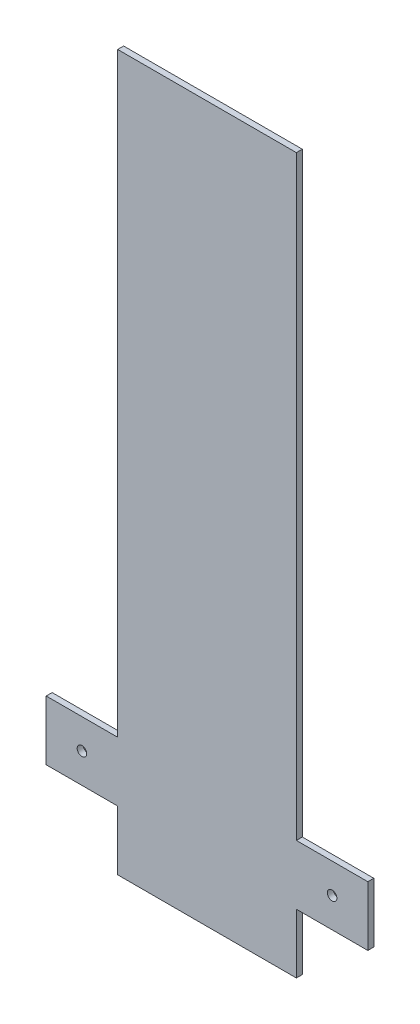
ISO-10303-21;
HEADER;
FILE_DESCRIPTION(('STEP AP214'),'2;1');
FILE_NAME('part.step','',(''),(''),'','','');
FILE_SCHEMA(('AUTOMOTIVE_DESIGN { 1 0 10303 214 1 1 1 1 }'));
ENDSEC;
DATA;
#1=APPLICATION_CONTEXT('core data for automotive mechanical design processes');
#2=APPLICATION_PROTOCOL_DEFINITION('international standard','automotive_design',2000,#1);
#3=PRODUCT_CONTEXT('',#1,'mechanical');
#4=PRODUCT('Part','Part','',(#3));
#5=PRODUCT_RELATED_PRODUCT_CATEGORY('part','',(#4));
#6=PRODUCT_DEFINITION_FORMATION('','',#4);
#7=PRODUCT_DEFINITION_CONTEXT('part definition',#1,'design');
#8=PRODUCT_DEFINITION('design','',#6,#7);
#9=PRODUCT_DEFINITION_SHAPE('','',#8);
#10=(LENGTH_UNIT() NAMED_UNIT(*) SI_UNIT(.MILLI.,.METRE.));
#11=(NAMED_UNIT(*) PLANE_ANGLE_UNIT() SI_UNIT($,.RADIAN.));
#12=(NAMED_UNIT(*) SI_UNIT($,.STERADIAN.) SOLID_ANGLE_UNIT());
#13=UNCERTAINTY_MEASURE_WITH_UNIT(LENGTH_MEASURE(1.E-05),#10,'distance_accuracy_value','');
#14=(GEOMETRIC_REPRESENTATION_CONTEXT(3) GLOBAL_UNCERTAINTY_ASSIGNED_CONTEXT((#13)) GLOBAL_UNIT_ASSIGNED_CONTEXT((#10,
#11,#12)) REPRESENTATION_CONTEXT('',''));
#15=CARTESIAN_POINT('',(0.,0.,0.));
#16=DIRECTION('',(0.,0.,1.));
#17=DIRECTION('',(1.,0.,0.));
#18=AXIS2_PLACEMENT_3D('',#15,#16,#17);
#19=CARTESIAN_POINT('',(0.,0.,5.));
#20=DIRECTION('',(0.,0.,1.));
#21=DIRECTION('',(1.,0.,0.));
#22=AXIS2_PLACEMENT_3D('',#19,#20,#21);
#23=PLANE('',#22);
#24=CARTESIAN_POINT('',(-105.,-225.,5.));
#25=DIRECTION('',(0.,0.,1.));
#26=DIRECTION('',(1.,0.,0.));
#27=AXIS2_PLACEMENT_3D('',#24,#25,#26);
#28=CIRCLE('',#27,3.99999999999999);
#29=CARTESIAN_POINT('',(-101.,-225.,5.));
#30=VERTEX_POINT('',#29);
#31=EDGE_CURVE('E224',#30,#30,#28,.T.);
#32=ORIENTED_EDGE('',*,*,#31,.F.);
#33=EDGE_LOOP('',(#32));
#34=FACE_BOUND('',#33,.T.);
#35=DIRECTION('',(1.,0.,0.));
#36=VECTOR('',#35,1.);
#37=CARTESIAN_POINT('',(135.,-250.,5.));
#38=LINE('',#37,#36);
#39=CARTESIAN_POINT('',(75.,-250.,5.));
#40=VERTEX_POINT('',#39);
#41=CARTESIAN_POINT('',(135.,-250.,5.));
#42=VERTEX_POINT('',#41);
#43=EDGE_CURVE('E215',#40,#42,#38,.T.);
#44=ORIENTED_EDGE('',*,*,#43,.T.);
#45=DIRECTION('',(0.,1.,0.));
#46=VECTOR('',#45,1.);
#47=CARTESIAN_POINT('',(135.,-200.,5.));
#48=LINE('',#47,#46);
#49=CARTESIAN_POINT('',(135.,-200.,5.));
#50=VERTEX_POINT('',#49);
#51=EDGE_CURVE('E115',#42,#50,#48,.T.);
#52=ORIENTED_EDGE('',*,*,#51,.T.);
#53=DIRECTION('',(-1.,0.,0.));
#54=VECTOR('',#53,1.);
#55=CARTESIAN_POINT('',(75.,-200.,5.));
#56=LINE('',#55,#54);
#57=CARTESIAN_POINT('',(75.,-200.,5.));
#58=VERTEX_POINT('',#57);
#59=EDGE_CURVE('E204',#50,#58,#56,.T.);
#60=ORIENTED_EDGE('',*,*,#59,.T.);
#61=DIRECTION('',(0.,1.,0.));
#62=VECTOR('',#61,1.);
#63=CARTESIAN_POINT('',(75.,300.,5.));
#64=LINE('',#63,#62);
#65=CARTESIAN_POINT('',(75.,300.,5.));
#66=VERTEX_POINT('',#65);
#67=EDGE_CURVE('E200',#58,#66,#64,.T.);
#68=ORIENTED_EDGE('',*,*,#67,.T.);
#69=DIRECTION('',(-1.,0.,0.));
#70=VECTOR('',#69,1.);
#71=CARTESIAN_POINT('',(75.,300.,5.));
#72=LINE('',#71,#70);
#73=CARTESIAN_POINT('',(-75.,300.,5.));
#74=VERTEX_POINT('',#73);
#75=EDGE_CURVE('E197',#66,#74,#72,.T.);
#76=ORIENTED_EDGE('',*,*,#75,.T.);
#77=DIRECTION('',(0.,-1.,0.));
#78=VECTOR('',#77,1.);
#79=CARTESIAN_POINT('',(-75.,300.,5.));
#80=LINE('',#79,#78);
#81=CARTESIAN_POINT('',(-75.,-200.,5.));
#82=VERTEX_POINT('',#81);
#83=EDGE_CURVE('E189',#74,#82,#80,.T.);
#84=ORIENTED_EDGE('',*,*,#83,.T.);
#85=DIRECTION('',(-1.,0.,0.));
#86=VECTOR('',#85,1.);
#87=CARTESIAN_POINT('',(-75.,-200.,5.));
#88=LINE('',#87,#86);
#89=CARTESIAN_POINT('',(-135.,-200.,5.));
#90=VERTEX_POINT('',#89);
#91=EDGE_CURVE('E185',#82,#90,#88,.T.);
#92=ORIENTED_EDGE('',*,*,#91,.T.);
#93=DIRECTION('',(0.,-1.,0.));
#94=VECTOR('',#93,1.);
#95=CARTESIAN_POINT('',(-135.,-200.,5.));
#96=LINE('',#95,#94);
#97=CARTESIAN_POINT('',(-135.,-250.,5.));
#98=VERTEX_POINT('',#97);
#99=EDGE_CURVE('E181',#90,#98,#96,.T.);
#100=ORIENTED_EDGE('',*,*,#99,.T.);
#101=DIRECTION('',(1.,0.,0.));
#102=VECTOR('',#101,1.);
#103=CARTESIAN_POINT('',(-135.,-250.,5.));
#104=LINE('',#103,#102);
#105=CARTESIAN_POINT('',(-75.,-250.,5.));
#106=VERTEX_POINT('',#105);
#107=EDGE_CURVE('E146',#98,#106,#104,.T.);
#108=ORIENTED_EDGE('',*,*,#107,.T.);
#109=DIRECTION('',(0.,-1.,0.));
#110=VECTOR('',#109,1.);
#111=CARTESIAN_POINT('',(-75.,-250.,5.));
#112=LINE('',#111,#110);
#113=CARTESIAN_POINT('',(-75.,-300.,5.));
#114=VERTEX_POINT('',#113);
#115=EDGE_CURVE('E140',#106,#114,#112,.T.);
#116=ORIENTED_EDGE('',*,*,#115,.T.);
#117=DIRECTION('',(1.,0.,0.));
#118=VECTOR('',#117,1.);
#119=CARTESIAN_POINT('',(-75.,-300.,5.));
#120=LINE('',#119,#118);
#121=CARTESIAN_POINT('',(75.,-300.,5.));
#122=VERTEX_POINT('',#121);
#123=EDGE_CURVE('E144',#114,#122,#120,.T.);
#124=ORIENTED_EDGE('',*,*,#123,.T.);
#125=DIRECTION('',(0.,1.,0.));
#126=VECTOR('',#125,1.);
#127=CARTESIAN_POINT('',(75.,-250.,5.));
#128=LINE('',#127,#126);
#129=EDGE_CURVE('E60',#122,#40,#128,.T.);
#130=ORIENTED_EDGE('',*,*,#129,.T.);
#131=EDGE_LOOP('',(#44,#52,#60,#68,#76,#84,#92,#100,#108,#116,#124,#130));
#132=FACE_BOUND('',#131,.T.);
#133=CARTESIAN_POINT('',(105.,-225.,5.));
#134=DIRECTION('',(0.,0.,1.));
#135=DIRECTION('',(1.,0.,0.));
#136=AXIS2_PLACEMENT_3D('',#133,#134,#135);
#137=CIRCLE('',#136,3.99999999999999);
#138=CARTESIAN_POINT('',(109.,-225.,5.));
#139=VERTEX_POINT('',#138);
#140=EDGE_CURVE('E225',#139,#139,#137,.T.);
#141=ORIENTED_EDGE('',*,*,#140,.F.);
#142=EDGE_LOOP('',(#141));
#143=FACE_BOUND('',#142,.T.);
#144=ADVANCED_FACE('F41',(#34,#132,#143),#23,.T.);
#145=CARTESIAN_POINT('',(0.,0.,0.));
#146=DIRECTION('',(0.,0.,1.));
#147=DIRECTION('',(1.,0.,0.));
#148=AXIS2_PLACEMENT_3D('',#145,#146,#147);
#149=PLANE('',#148);
#150=DIRECTION('',(1.,0.,0.));
#151=VECTOR('',#150,1.);
#152=CARTESIAN_POINT('',(135.,-250.,0.));
#153=LINE('',#152,#151);
#154=CARTESIAN_POINT('',(75.,-250.,0.));
#155=VERTEX_POINT('',#154);
#156=CARTESIAN_POINT('',(135.,-250.,0.));
#157=VERTEX_POINT('',#156);
#158=EDGE_CURVE('E311',#155,#157,#153,.T.);
#159=ORIENTED_EDGE('',*,*,#158,.F.);
#160=DIRECTION('',(0.,1.,0.));
#161=VECTOR('',#160,1.);
#162=CARTESIAN_POINT('',(75.,-250.,0.));
#163=LINE('',#162,#161);
#164=CARTESIAN_POINT('',(75.,-300.,0.));
#165=VERTEX_POINT('',#164);
#166=EDGE_CURVE('E107',#165,#155,#163,.T.);
#167=ORIENTED_EDGE('',*,*,#166,.F.);
#168=DIRECTION('',(1.,0.,0.));
#169=VECTOR('',#168,1.);
#170=CARTESIAN_POINT('',(-75.,-300.,0.));
#171=LINE('',#170,#169);
#172=CARTESIAN_POINT('',(-75.,-300.,0.));
#173=VERTEX_POINT('',#172);
#174=EDGE_CURVE('E101',#173,#165,#171,.T.);
#175=ORIENTED_EDGE('',*,*,#174,.F.);
#176=DIRECTION('',(0.,-1.,0.));
#177=VECTOR('',#176,1.);
#178=CARTESIAN_POINT('',(-75.,-250.,0.));
#179=LINE('',#178,#177);
#180=CARTESIAN_POINT('',(-75.,-250.,0.));
#181=VERTEX_POINT('',#180);
#182=EDGE_CURVE('E155',#181,#173,#179,.T.);
#183=ORIENTED_EDGE('',*,*,#182,.F.);
#184=DIRECTION('',(1.,0.,0.));
#185=VECTOR('',#184,1.);
#186=CARTESIAN_POINT('',(-135.,-250.,0.));
#187=LINE('',#186,#185);
#188=CARTESIAN_POINT('',(-135.,-250.,0.));
#189=VERTEX_POINT('',#188);
#190=EDGE_CURVE('E415',#189,#181,#187,.T.);
#191=ORIENTED_EDGE('',*,*,#190,.F.);
#192=DIRECTION('',(0.,-1.,0.));
#193=VECTOR('',#192,1.);
#194=CARTESIAN_POINT('',(-135.,-200.,0.));
#195=LINE('',#194,#193);
#196=CARTESIAN_POINT('',(-135.,-200.,0.));
#197=VERTEX_POINT('',#196);
#198=EDGE_CURVE('E413',#197,#189,#195,.T.);
#199=ORIENTED_EDGE('',*,*,#198,.F.);
#200=DIRECTION('',(-1.,0.,0.));
#201=VECTOR('',#200,1.);
#202=CARTESIAN_POINT('',(-75.,-200.,0.));
#203=LINE('',#202,#201);
#204=CARTESIAN_POINT('',(-75.,-200.,0.));
#205=VERTEX_POINT('',#204);
#206=EDGE_CURVE('E409',#205,#197,#203,.T.);
#207=ORIENTED_EDGE('',*,*,#206,.F.);
#208=DIRECTION('',(0.,-1.,0.));
#209=VECTOR('',#208,1.);
#210=CARTESIAN_POINT('',(-75.,300.,0.));
#211=LINE('',#210,#209);
#212=CARTESIAN_POINT('',(-75.,300.,0.));
#213=VERTEX_POINT('',#212);
#214=EDGE_CURVE('E405',#213,#205,#211,.T.);
#215=ORIENTED_EDGE('',*,*,#214,.F.);
#216=DIRECTION('',(-1.,0.,0.));
#217=VECTOR('',#216,1.);
#218=CARTESIAN_POINT('',(75.,300.,0.));
#219=LINE('',#218,#217);
#220=CARTESIAN_POINT('',(75.,300.,0.));
#221=VERTEX_POINT('',#220);
#222=EDGE_CURVE('E324',#221,#213,#219,.T.);
#223=ORIENTED_EDGE('',*,*,#222,.F.);
#224=DIRECTION('',(0.,1.,0.));
#225=VECTOR('',#224,1.);
#226=CARTESIAN_POINT('',(75.,300.,0.));
#227=LINE('',#226,#225);
#228=CARTESIAN_POINT('',(75.,-200.,0.));
#229=VERTEX_POINT('',#228);
#230=EDGE_CURVE('E320',#229,#221,#227,.T.);
#231=ORIENTED_EDGE('',*,*,#230,.F.);
#232=DIRECTION('',(-1.,0.,0.));
#233=VECTOR('',#232,1.);
#234=CARTESIAN_POINT('',(75.,-200.,0.));
#235=LINE('',#234,#233);
#236=CARTESIAN_POINT('',(135.,-200.,0.));
#237=VERTEX_POINT('',#236);
#238=EDGE_CURVE('E310',#237,#229,#235,.T.);
#239=ORIENTED_EDGE('',*,*,#238,.F.);
#240=DIRECTION('',(0.,1.,0.));
#241=VECTOR('',#240,1.);
#242=CARTESIAN_POINT('',(135.,-200.,0.));
#243=LINE('',#242,#241);
#244=EDGE_CURVE('E302',#157,#237,#243,.T.);
#245=ORIENTED_EDGE('',*,*,#244,.F.);
#246=EDGE_LOOP('',(#159,#167,#175,#183,#191,#199,#207,#215,#223,#231,#239,#245));
#247=FACE_BOUND('',#246,.T.);
#248=CARTESIAN_POINT('',(-105.,-225.,0.));
#249=DIRECTION('',(0.,0.,1.));
#250=DIRECTION('',(1.,0.,0.));
#251=AXIS2_PLACEMENT_3D('',#248,#249,#250);
#252=CIRCLE('',#251,3.99999999999999);
#253=CARTESIAN_POINT('',(-101.,-225.,0.));
#254=VERTEX_POINT('',#253);
#255=EDGE_CURVE('E219',#254,#254,#252,.T.);
#256=ORIENTED_EDGE('',*,*,#255,.T.);
#257=EDGE_LOOP('',(#256));
#258=FACE_BOUND('',#257,.T.);
#259=CARTESIAN_POINT('',(105.,-225.,0.));
#260=DIRECTION('',(0.,0.,1.));
#261=DIRECTION('',(1.,0.,0.));
#262=AXIS2_PLACEMENT_3D('',#259,#260,#261);
#263=CIRCLE('',#262,3.99999999999999);
#264=CARTESIAN_POINT('',(109.,-225.,0.));
#265=VERTEX_POINT('',#264);
#266=EDGE_CURVE('E234',#265,#265,#263,.T.);
#267=ORIENTED_EDGE('',*,*,#266,.T.);
#268=EDGE_LOOP('',(#267));
#269=FACE_BOUND('',#268,.T.);
#270=ADVANCED_FACE('F240',(#247,#258,#269),#149,.F.);
#271=CARTESIAN_POINT('',(135.,-250.,5.));
#272=DIRECTION('',(0.,1.,0.));
#273=DIRECTION('',(0.,0.,1.));
#274=AXIS2_PLACEMENT_3D('',#271,#272,#273);
#275=PLANE('',#274);
#276=ORIENTED_EDGE('',*,*,#158,.T.);
#277=DIRECTION('',(0.,0.,-1.));
#278=VECTOR('',#277,1.);
#279=CARTESIAN_POINT('',(135.,-250.,5.));
#280=LINE('',#279,#278);
#281=EDGE_CURVE('E12',#42,#157,#280,.T.);
#282=ORIENTED_EDGE('',*,*,#281,.F.);
#283=ORIENTED_EDGE('',*,*,#43,.F.);
#284=DIRECTION('',(0.,0.,-1.));
#285=VECTOR('',#284,1.);
#286=CARTESIAN_POINT('',(75.,-250.,5.));
#287=LINE('',#286,#285);
#288=EDGE_CURVE('E164',#40,#155,#287,.T.);
#289=ORIENTED_EDGE('',*,*,#288,.T.);
#290=EDGE_LOOP('',(#276,#282,#283,#289));
#291=FACE_BOUND('',#290,.T.);
#292=ADVANCED_FACE('F43',(#291),#275,.F.);
#293=CARTESIAN_POINT('',(135.,-200.,5.));
#294=DIRECTION('',(-1.,0.,0.));
#295=DIRECTION('',(0.,0.,1.));
#296=AXIS2_PLACEMENT_3D('',#293,#294,#295);
#297=PLANE('',#296);
#298=ORIENTED_EDGE('',*,*,#244,.T.);
#299=DIRECTION('',(0.,0.,-1.));
#300=VECTOR('',#299,1.);
#301=CARTESIAN_POINT('',(135.,-200.,5.));
#302=LINE('',#301,#300);
#303=EDGE_CURVE('E52',#50,#237,#302,.T.);
#304=ORIENTED_EDGE('',*,*,#303,.F.);
#305=ORIENTED_EDGE('',*,*,#51,.F.);
#306=ORIENTED_EDGE('',*,*,#281,.T.);
#307=EDGE_LOOP('',(#298,#304,#305,#306));
#308=FACE_BOUND('',#307,.T.);
#309=ADVANCED_FACE('F295',(#308),#297,.F.);
#310=CARTESIAN_POINT('',(75.,-200.,5.));
#311=DIRECTION('',(0.,-1.,0.));
#312=DIRECTION('',(0.,0.,-1.));
#313=AXIS2_PLACEMENT_3D('',#310,#311,#312);
#314=PLANE('',#313);
#315=ORIENTED_EDGE('',*,*,#238,.T.);
#316=DIRECTION('',(0.,0.,-1.));
#317=VECTOR('',#316,1.);
#318=CARTESIAN_POINT('',(75.,-200.,5.));
#319=LINE('',#318,#317);
#320=EDGE_CURVE('E316',#58,#229,#319,.T.);
#321=ORIENTED_EDGE('',*,*,#320,.F.);
#322=ORIENTED_EDGE('',*,*,#59,.F.);
#323=ORIENTED_EDGE('',*,*,#303,.T.);
#324=EDGE_LOOP('',(#315,#321,#322,#323));
#325=FACE_BOUND('',#324,.T.);
#326=ADVANCED_FACE('F292',(#325),#314,.F.);
#327=CARTESIAN_POINT('',(75.,300.,5.));
#328=DIRECTION('',(-1.,0.,0.));
#329=DIRECTION('',(0.,0.,1.));
#330=AXIS2_PLACEMENT_3D('',#327,#328,#329);
#331=PLANE('',#330);
#332=ORIENTED_EDGE('',*,*,#230,.T.);
#333=DIRECTION('',(0.,0.,-1.));
#334=VECTOR('',#333,1.);
#335=CARTESIAN_POINT('',(75.,300.,5.));
#336=LINE('',#335,#334);
#337=EDGE_CURVE('E383',#66,#221,#336,.T.);
#338=ORIENTED_EDGE('',*,*,#337,.F.);
#339=ORIENTED_EDGE('',*,*,#67,.F.);
#340=ORIENTED_EDGE('',*,*,#320,.T.);
#341=EDGE_LOOP('',(#332,#338,#339,#340));
#342=FACE_BOUND('',#341,.T.);
#343=ADVANCED_FACE('F288',(#342),#331,.F.);
#344=CARTESIAN_POINT('',(75.,300.,5.));
#345=DIRECTION('',(0.,-1.,0.));
#346=DIRECTION('',(0.,0.,-1.));
#347=AXIS2_PLACEMENT_3D('',#344,#345,#346);
#348=PLANE('',#347);
#349=ORIENTED_EDGE('',*,*,#222,.T.);
#350=DIRECTION('',(0.,0.,-1.));
#351=VECTOR('',#350,1.);
#352=CARTESIAN_POINT('',(-75.,300.,5.));
#353=LINE('',#352,#351);
#354=EDGE_CURVE('E378',#74,#213,#353,.T.);
#355=ORIENTED_EDGE('',*,*,#354,.F.);
#356=ORIENTED_EDGE('',*,*,#75,.F.);
#357=ORIENTED_EDGE('',*,*,#337,.T.);
#358=EDGE_LOOP('',(#349,#355,#356,#357));
#359=FACE_BOUND('',#358,.T.);
#360=ADVANCED_FACE('F284',(#359),#348,.F.);
#361=CARTESIAN_POINT('',(-75.,300.,5.));
#362=DIRECTION('',(1.,0.,0.));
#363=DIRECTION('',(0.,0.,-1.));
#364=AXIS2_PLACEMENT_3D('',#361,#362,#363);
#365=PLANE('',#364);
#366=ORIENTED_EDGE('',*,*,#214,.T.);
#367=DIRECTION('',(0.,0.,-1.));
#368=VECTOR('',#367,1.);
#369=CARTESIAN_POINT('',(-75.,-200.,5.));
#370=LINE('',#369,#368);
#371=EDGE_CURVE('E374',#82,#205,#370,.T.);
#372=ORIENTED_EDGE('',*,*,#371,.F.);
#373=ORIENTED_EDGE('',*,*,#83,.F.);
#374=ORIENTED_EDGE('',*,*,#354,.T.);
#375=EDGE_LOOP('',(#366,#372,#373,#374));
#376=FACE_BOUND('',#375,.T.);
#377=ADVANCED_FACE('F280',(#376),#365,.F.);
#378=CARTESIAN_POINT('',(-75.,-200.,5.));
#379=DIRECTION('',(0.,-1.,0.));
#380=DIRECTION('',(0.,0.,-1.));
#381=AXIS2_PLACEMENT_3D('',#378,#379,#380);
#382=PLANE('',#381);
#383=ORIENTED_EDGE('',*,*,#206,.T.);
#384=DIRECTION('',(0.,0.,-1.));
#385=VECTOR('',#384,1.);
#386=CARTESIAN_POINT('',(-135.,-200.,5.));
#387=LINE('',#386,#385);
#388=EDGE_CURVE('E366',#90,#197,#387,.T.);
#389=ORIENTED_EDGE('',*,*,#388,.F.);
#390=ORIENTED_EDGE('',*,*,#91,.F.);
#391=ORIENTED_EDGE('',*,*,#371,.T.);
#392=EDGE_LOOP('',(#383,#389,#390,#391));
#393=FACE_BOUND('',#392,.T.);
#394=ADVANCED_FACE('F276',(#393),#382,.F.);
#395=CARTESIAN_POINT('',(-135.,-200.,5.));
#396=DIRECTION('',(1.,0.,0.));
#397=DIRECTION('',(0.,0.,-1.));
#398=AXIS2_PLACEMENT_3D('',#395,#396,#397);
#399=PLANE('',#398);
#400=ORIENTED_EDGE('',*,*,#198,.T.);
#401=DIRECTION('',(0.,0.,-1.));
#402=VECTOR('',#401,1.);
#403=CARTESIAN_POINT('',(-135.,-250.,5.));
#404=LINE('',#403,#402);
#405=EDGE_CURVE('E361',#98,#189,#404,.T.);
#406=ORIENTED_EDGE('',*,*,#405,.F.);
#407=ORIENTED_EDGE('',*,*,#99,.F.);
#408=ORIENTED_EDGE('',*,*,#388,.T.);
#409=EDGE_LOOP('',(#400,#406,#407,#408));
#410=FACE_BOUND('',#409,.T.);
#411=ADVANCED_FACE('F272',(#410),#399,.F.);
#412=CARTESIAN_POINT('',(-135.,-250.,5.));
#413=DIRECTION('',(0.,1.,0.));
#414=DIRECTION('',(0.,0.,1.));
#415=AXIS2_PLACEMENT_3D('',#412,#413,#414);
#416=PLANE('',#415);
#417=ORIENTED_EDGE('',*,*,#190,.T.);
#418=DIRECTION('',(0.,0.,-1.));
#419=VECTOR('',#418,1.);
#420=CARTESIAN_POINT('',(-75.,-250.,5.));
#421=LINE('',#420,#419);
#422=EDGE_CURVE('E157',#106,#181,#421,.T.);
#423=ORIENTED_EDGE('',*,*,#422,.F.);
#424=ORIENTED_EDGE('',*,*,#107,.F.);
#425=ORIENTED_EDGE('',*,*,#405,.T.);
#426=EDGE_LOOP('',(#417,#423,#424,#425));
#427=FACE_BOUND('',#426,.T.);
#428=ADVANCED_FACE('F269',(#427),#416,.F.);
#429=CARTESIAN_POINT('',(-75.,-250.,5.));
#430=DIRECTION('',(1.,0.,0.));
#431=DIRECTION('',(0.,0.,-1.));
#432=AXIS2_PLACEMENT_3D('',#429,#430,#431);
#433=PLANE('',#432);
#434=ORIENTED_EDGE('',*,*,#182,.T.);
#435=DIRECTION('',(0.,0.,-1.));
#436=VECTOR('',#435,1.);
#437=CARTESIAN_POINT('',(-75.,-300.,5.));
#438=LINE('',#437,#436);
#439=EDGE_CURVE('E152',#114,#173,#438,.T.);
#440=ORIENTED_EDGE('',*,*,#439,.F.);
#441=ORIENTED_EDGE('',*,*,#115,.F.);
#442=ORIENTED_EDGE('',*,*,#422,.T.);
#443=EDGE_LOOP('',(#434,#440,#441,#442));
#444=FACE_BOUND('',#443,.T.);
#445=ADVANCED_FACE('F153',(#444),#433,.F.);
#446=CARTESIAN_POINT('',(-75.,-300.,5.));
#447=DIRECTION('',(0.,1.,0.));
#448=DIRECTION('',(0.,0.,1.));
#449=AXIS2_PLACEMENT_3D('',#446,#447,#448);
#450=PLANE('',#449);
#451=ORIENTED_EDGE('',*,*,#174,.T.);
#452=DIRECTION('',(0.,0.,-1.));
#453=VECTOR('',#452,1.);
#454=CARTESIAN_POINT('',(75.,-300.,5.));
#455=LINE('',#454,#453);
#456=EDGE_CURVE('E158',#122,#165,#455,.T.);
#457=ORIENTED_EDGE('',*,*,#456,.F.);
#458=ORIENTED_EDGE('',*,*,#123,.F.);
#459=ORIENTED_EDGE('',*,*,#439,.T.);
#460=EDGE_LOOP('',(#451,#457,#458,#459));
#461=FACE_BOUND('',#460,.T.);
#462=ADVANCED_FACE('F160',(#461),#450,.F.);
#463=CARTESIAN_POINT('',(75.,-250.,5.));
#464=DIRECTION('',(-1.,0.,0.));
#465=DIRECTION('',(0.,0.,1.));
#466=AXIS2_PLACEMENT_3D('',#463,#464,#465);
#467=PLANE('',#466);
#468=ORIENTED_EDGE('',*,*,#166,.T.);
#469=ORIENTED_EDGE('',*,*,#288,.F.);
#470=ORIENTED_EDGE('',*,*,#129,.F.);
#471=ORIENTED_EDGE('',*,*,#456,.T.);
#472=EDGE_LOOP('',(#468,#469,#470,#471));
#473=FACE_BOUND('',#472,.T.);
#474=ADVANCED_FACE('F250',(#473),#467,.F.);
#475=CARTESIAN_POINT('',(-105.,-225.,5.));
#476=DIRECTION('',(0.,0.,-1.));
#477=DIRECTION('',(-1.,0.,0.));
#478=AXIS2_PLACEMENT_3D('',#475,#476,#477);
#479=CYLINDRICAL_SURFACE('',#478,3.99999999999999);
#480=ORIENTED_EDGE('',*,*,#31,.T.);
#481=EDGE_LOOP('',(#480));
#482=FACE_BOUND('',#481,.T.);
#483=ORIENTED_EDGE('',*,*,#255,.F.);
#484=EDGE_LOOP('',(#483));
#485=FACE_BOUND('',#484,.T.);
#486=ADVANCED_FACE('F244',(#482,#485),#479,.F.);
#487=CARTESIAN_POINT('',(105.,-225.,5.));
#488=DIRECTION('',(0.,0.,-1.));
#489=DIRECTION('',(-1.,0.,0.));
#490=AXIS2_PLACEMENT_3D('',#487,#488,#489);
#491=CYLINDRICAL_SURFACE('',#490,3.99999999999999);
#492=ORIENTED_EDGE('',*,*,#140,.T.);
#493=EDGE_LOOP('',(#492));
#494=FACE_BOUND('',#493,.T.);
#495=ORIENTED_EDGE('',*,*,#266,.F.);
#496=EDGE_LOOP('',(#495));
#497=FACE_BOUND('',#496,.T.);
#498=ADVANCED_FACE('F242',(#494,#497),#491,.F.);
#499=CLOSED_SHELL('',(#144,#270,#292,#309,#326,#343,#360,#377,#394,#411,#428,#445,#462,#474,
#486,#498));
#500=MANIFOLD_SOLID_BREP('B2',#499);
#501=ADVANCED_BREP_SHAPE_REPRESENTATION('',(#18,#500),#14);
#502=SHAPE_DEFINITION_REPRESENTATION(#9,#501);
ENDSEC;
END-ISO-10303-21;
